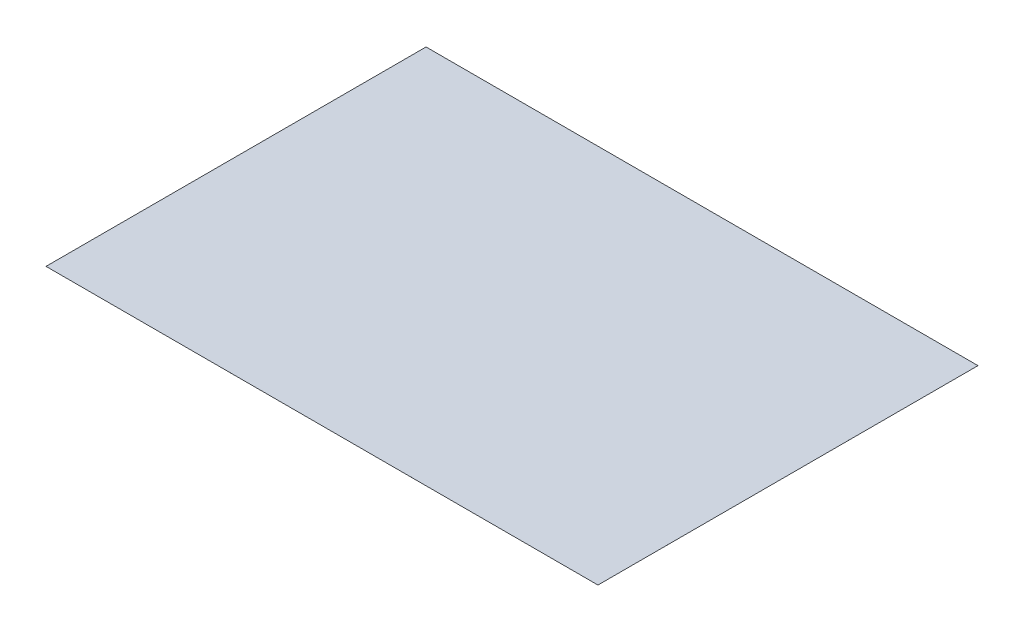
ISO-10303-21;
HEADER;
FILE_DESCRIPTION(('STEP AP214'),'2;1');
FILE_NAME('part.step','',(''),(''),'','','');
FILE_SCHEMA(('AUTOMOTIVE_DESIGN { 1 0 10303 214 1 1 1 1 }'));
ENDSEC;
DATA;
#1=APPLICATION_CONTEXT('core data for automotive mechanical design processes');
#2=APPLICATION_PROTOCOL_DEFINITION('international standard','automotive_design',2000,#1);
#3=PRODUCT_CONTEXT('',#1,'mechanical');
#4=PRODUCT('Part','Part','',(#3));
#5=PRODUCT_RELATED_PRODUCT_CATEGORY('part','',(#4));
#6=PRODUCT_DEFINITION_FORMATION('','',#4);
#7=PRODUCT_DEFINITION_CONTEXT('part definition',#1,'design');
#8=PRODUCT_DEFINITION('design','',#6,#7);
#9=PRODUCT_DEFINITION_SHAPE('','',#8);
#10=(LENGTH_UNIT() NAMED_UNIT(*) SI_UNIT(.MILLI.,.METRE.));
#11=(NAMED_UNIT(*) PLANE_ANGLE_UNIT() SI_UNIT($,.RADIAN.));
#12=(NAMED_UNIT(*) SI_UNIT($,.STERADIAN.) SOLID_ANGLE_UNIT());
#13=UNCERTAINTY_MEASURE_WITH_UNIT(LENGTH_MEASURE(1.E-05),#10,'distance_accuracy_value','');
#14=(GEOMETRIC_REPRESENTATION_CONTEXT(3) GLOBAL_UNCERTAINTY_ASSIGNED_CONTEXT((#13)) GLOBAL_UNIT_ASSIGNED_CONTEXT((#10,
#11,#12)) REPRESENTATION_CONTEXT('',''));
#15=CARTESIAN_POINT('',(0.,0.,0.));
#16=DIRECTION('',(0.,0.,1.));
#17=DIRECTION('',(1.,0.,0.));
#18=AXIS2_PLACEMENT_3D('',#15,#16,#17);
#19=CARTESIAN_POINT('',(-33.9488266459115,0.0001,-19.2890588057979));
#20=DIRECTION('',(1.,0.,0.));
#21=DIRECTION('',(0.,0.,-1.));
#22=AXIS2_PLACEMENT_3D('',#19,#20,#21);
#23=PLANE('',#22);
#24=DIRECTION('',(0.,0.,1.));
#25=VECTOR('',#24,1.);
#26=CARTESIAN_POINT('',(-33.9488266459115,0.,-19.2890588057979));
#27=LINE('',#26,#25);
#28=CARTESIAN_POINT('',(-33.9488266459115,0.,-19.2890588057979));
#29=VERTEX_POINT('',#28);
#30=CARTESIAN_POINT('',(-33.9488266459115,0.,20.0609411942021));
#31=VERTEX_POINT('',#30);
#32=EDGE_CURVE('E96',#29,#31,#27,.T.);
#33=ORIENTED_EDGE('',*,*,#32,.T.);
#34=DIRECTION('',(0.,-1.,0.));
#35=VECTOR('',#34,1.);
#36=CARTESIAN_POINT('',(-33.9488266459115,0.0001,20.0609411942021));
#37=LINE('',#36,#35);
#38=CARTESIAN_POINT('',(-33.9488266459115,0.0001,20.0609411942021));
#39=VERTEX_POINT('',#38);
#40=EDGE_CURVE('E11',#39,#31,#37,.T.);
#41=ORIENTED_EDGE('',*,*,#40,.F.);
#42=DIRECTION('',(0.,0.,1.));
#43=VECTOR('',#42,1.);
#44=CARTESIAN_POINT('',(-33.9488266459115,0.0001,-19.2890588057979));
#45=LINE('',#44,#43);
#46=CARTESIAN_POINT('',(-33.9488266459115,0.0001,-19.2890588057979));
#47=VERTEX_POINT('',#46);
#48=EDGE_CURVE('E84',#47,#39,#45,.T.);
#49=ORIENTED_EDGE('',*,*,#48,.F.);
#50=DIRECTION('',(0.,-1.,0.));
#51=VECTOR('',#50,1.);
#52=CARTESIAN_POINT('',(-33.9488266459115,0.0001,-19.2890588057979));
#53=LINE('',#52,#51);
#54=EDGE_CURVE('E92',#47,#29,#53,.T.);
#55=ORIENTED_EDGE('',*,*,#54,.T.);
#56=EDGE_LOOP('',(#33,#41,#49,#55));
#57=FACE_BOUND('',#56,.T.);
#58=ADVANCED_FACE('F33',(#57),#23,.F.);
#59=CARTESIAN_POINT('',(-33.9488266459115,0.0001,20.0609411942021));
#60=DIRECTION('',(0.,0.,-1.));
#61=DIRECTION('',(-1.,0.,0.));
#62=AXIS2_PLACEMENT_3D('',#59,#60,#61);
#63=PLANE('',#62);
#64=DIRECTION('',(1.,0.,0.));
#65=VECTOR('',#64,1.);
#66=CARTESIAN_POINT('',(-33.9488266459115,0.,20.0609411942021));
#67=LINE('',#66,#65);
#68=CARTESIAN_POINT('',(23.2011733540885,0.,20.0609411942021));
#69=VERTEX_POINT('',#68);
#70=EDGE_CURVE('E88',#31,#69,#67,.T.);
#71=ORIENTED_EDGE('',*,*,#70,.T.);
#72=DIRECTION('',(0.,-1.,0.));
#73=VECTOR('',#72,1.);
#74=CARTESIAN_POINT('',(23.2011733540885,0.0001,20.0609411942021));
#75=LINE('',#74,#73);
#76=CARTESIAN_POINT('',(23.2011733540885,0.0001,20.0609411942021));
#77=VERTEX_POINT('',#76);
#78=EDGE_CURVE('E41',#77,#69,#75,.T.);
#79=ORIENTED_EDGE('',*,*,#78,.F.);
#80=DIRECTION('',(1.,0.,0.));
#81=VECTOR('',#80,1.);
#82=CARTESIAN_POINT('',(-33.9488266459115,0.0001,20.0609411942021));
#83=LINE('',#82,#81);
#84=EDGE_CURVE('E79',#39,#77,#83,.T.);
#85=ORIENTED_EDGE('',*,*,#84,.F.);
#86=ORIENTED_EDGE('',*,*,#40,.T.);
#87=EDGE_LOOP('',(#71,#79,#85,#86));
#88=FACE_BOUND('',#87,.T.);
#89=ADVANCED_FACE('F87',(#88),#63,.F.);
#90=CARTESIAN_POINT('',(23.2011733540885,0.0001,-19.2890588057979));
#91=DIRECTION('',(-1.,0.,0.));
#92=DIRECTION('',(0.,0.,1.));
#93=AXIS2_PLACEMENT_3D('',#90,#91,#92);
#94=PLANE('',#93);
#95=DIRECTION('',(0.,0.,-1.));
#96=VECTOR('',#95,1.);
#97=CARTESIAN_POINT('',(23.2011733540885,0.,-19.2890588057979));
#98=LINE('',#97,#96);
#99=CARTESIAN_POINT('',(23.2011733540885,0.,-19.2890588057979));
#100=VERTEX_POINT('',#99);
#101=EDGE_CURVE('E66',#69,#100,#98,.T.);
#102=ORIENTED_EDGE('',*,*,#101,.T.);
#103=DIRECTION('',(0.,-1.,0.));
#104=VECTOR('',#103,1.);
#105=CARTESIAN_POINT('',(23.2011733540885,0.0001,-19.2890588057979));
#106=LINE('',#105,#104);
#107=CARTESIAN_POINT('',(23.2011733540885,0.0001,-19.2890588057979));
#108=VERTEX_POINT('',#107);
#109=EDGE_CURVE('E89',#108,#100,#106,.T.);
#110=ORIENTED_EDGE('',*,*,#109,.F.);
#111=DIRECTION('',(0.,0.,-1.));
#112=VECTOR('',#111,1.);
#113=CARTESIAN_POINT('',(23.2011733540885,0.0001,-19.2890588057979));
#114=LINE('',#113,#112);
#115=EDGE_CURVE('E82',#77,#108,#114,.T.);
#116=ORIENTED_EDGE('',*,*,#115,.F.);
#117=ORIENTED_EDGE('',*,*,#78,.T.);
#118=EDGE_LOOP('',(#102,#110,#116,#117));
#119=FACE_BOUND('',#118,.T.);
#120=ADVANCED_FACE('F90',(#119),#94,.F.);
#121=CARTESIAN_POINT('',(-33.9488266459115,0.0001,-19.2890588057979));
#122=DIRECTION('',(0.,0.,1.));
#123=DIRECTION('',(1.,0.,0.));
#124=AXIS2_PLACEMENT_3D('',#121,#122,#123);
#125=PLANE('',#124);
#126=DIRECTION('',(-1.,0.,0.));
#127=VECTOR('',#126,1.);
#128=CARTESIAN_POINT('',(-33.9488266459115,0.,-19.2890588057979));
#129=LINE('',#128,#127);
#130=EDGE_CURVE('E72',#100,#29,#129,.T.);
#131=ORIENTED_EDGE('',*,*,#130,.T.);
#132=ORIENTED_EDGE('',*,*,#54,.F.);
#133=DIRECTION('',(-1.,0.,0.));
#134=VECTOR('',#133,1.);
#135=CARTESIAN_POINT('',(-33.9488266459115,0.0001,-19.2890588057979));
#136=LINE('',#135,#134);
#137=EDGE_CURVE('E49',#108,#47,#136,.T.);
#138=ORIENTED_EDGE('',*,*,#137,.F.);
#139=ORIENTED_EDGE('',*,*,#109,.T.);
#140=EDGE_LOOP('',(#131,#132,#138,#139));
#141=FACE_BOUND('',#140,.T.);
#142=ADVANCED_FACE('F103',(#141),#125,.F.);
#143=CARTESIAN_POINT('',(0.,0.0001,0.));
#144=DIRECTION('',(0.,1.,0.));
#145=DIRECTION('',(0.,0.,1.));
#146=AXIS2_PLACEMENT_3D('',#143,#144,#145);
#147=PLANE('',#146);
#148=ORIENTED_EDGE('',*,*,#48,.T.);
#149=ORIENTED_EDGE('',*,*,#84,.T.);
#150=ORIENTED_EDGE('',*,*,#115,.T.);
#151=ORIENTED_EDGE('',*,*,#137,.T.);
#152=EDGE_LOOP('',(#148,#149,#150,#151));
#153=FACE_BOUND('',#152,.T.);
#154=ADVANCED_FACE('F80',(#153),#147,.T.);
#155=CARTESIAN_POINT('',(0.,0.,0.));
#156=DIRECTION('',(0.,1.,0.));
#157=DIRECTION('',(0.,0.,1.));
#158=AXIS2_PLACEMENT_3D('',#155,#156,#157);
#159=PLANE('',#158);
#160=ORIENTED_EDGE('',*,*,#32,.F.);
#161=ORIENTED_EDGE('',*,*,#130,.F.);
#162=ORIENTED_EDGE('',*,*,#101,.F.);
#163=ORIENTED_EDGE('',*,*,#70,.F.);
#164=EDGE_LOOP('',(#160,#161,#162,#163));
#165=FACE_BOUND('',#164,.T.);
#166=ADVANCED_FACE('F106',(#165),#159,.F.);
#167=CLOSED_SHELL('',(#58,#89,#120,#142,#154,#166));
#168=MANIFOLD_SOLID_BREP('B2',#167);
#169=ADVANCED_BREP_SHAPE_REPRESENTATION('',(#18,#168),#14);
#170=SHAPE_DEFINITION_REPRESENTATION(#9,#169);
ENDSEC;
END-ISO-10303-21;
